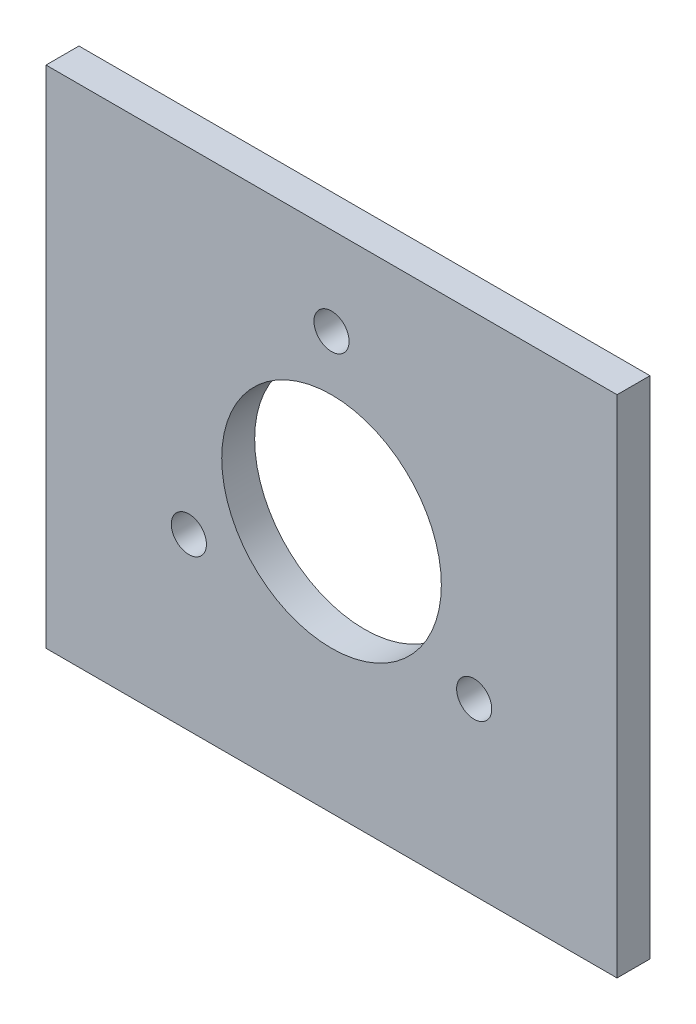
ISO-10303-21;
HEADER;
FILE_DESCRIPTION(('STEP AP214'),'2;1');
FILE_NAME('part.step','',(''),(''),'','','');
FILE_SCHEMA(('AUTOMOTIVE_DESIGN { 1 0 10303 214 1 1 1 1 }'));
ENDSEC;
DATA;
#1=APPLICATION_CONTEXT('core data for automotive mechanical design processes');
#2=APPLICATION_PROTOCOL_DEFINITION('international standard','automotive_design',2000,#1);
#3=PRODUCT_CONTEXT('',#1,'mechanical');
#4=PRODUCT('Part','Part','',(#3));
#5=PRODUCT_RELATED_PRODUCT_CATEGORY('part','',(#4));
#6=PRODUCT_DEFINITION_FORMATION('','',#4);
#7=PRODUCT_DEFINITION_CONTEXT('part definition',#1,'design');
#8=PRODUCT_DEFINITION('design','',#6,#7);
#9=PRODUCT_DEFINITION_SHAPE('','',#8);
#10=(LENGTH_UNIT() NAMED_UNIT(*) SI_UNIT(.MILLI.,.METRE.));
#11=(NAMED_UNIT(*) PLANE_ANGLE_UNIT() SI_UNIT($,.RADIAN.));
#12=(NAMED_UNIT(*) SI_UNIT($,.STERADIAN.) SOLID_ANGLE_UNIT());
#13=UNCERTAINTY_MEASURE_WITH_UNIT(LENGTH_MEASURE(1.E-05),#10,'distance_accuracy_value','');
#14=(GEOMETRIC_REPRESENTATION_CONTEXT(3) GLOBAL_UNCERTAINTY_ASSIGNED_CONTEXT((#13)) GLOBAL_UNIT_ASSIGNED_CONTEXT((#10,
#11,#12)) REPRESENTATION_CONTEXT('',''));
#15=CARTESIAN_POINT('',(0.,0.,0.));
#16=DIRECTION('',(0.,0.,1.));
#17=DIRECTION('',(1.,0.,0.));
#18=AXIS2_PLACEMENT_3D('',#15,#16,#17);
#19=CARTESIAN_POINT('',(-26.,-23.,3.));
#20=DIRECTION('',(1.,0.,0.));
#21=DIRECTION('',(0.,0.,-1.));
#22=AXIS2_PLACEMENT_3D('',#19,#20,#21);
#23=PLANE('',#22);
#24=DIRECTION('',(0.,-1.,0.));
#25=VECTOR('',#24,1.);
#26=CARTESIAN_POINT('',(-26.,-23.,0.));
#27=LINE('',#26,#25);
#28=CARTESIAN_POINT('',(-26.,23.,0.));
#29=VERTEX_POINT('',#28);
#30=CARTESIAN_POINT('',(-26.,-23.,0.));
#31=VERTEX_POINT('',#30);
#32=EDGE_CURVE('E102',#29,#31,#27,.T.);
#33=ORIENTED_EDGE('',*,*,#32,.T.);
#34=DIRECTION('',(0.,0.,-1.));
#35=VECTOR('',#34,1.);
#36=CARTESIAN_POINT('',(-26.,-23.,3.));
#37=LINE('',#36,#35);
#38=CARTESIAN_POINT('',(-26.,-23.,3.));
#39=VERTEX_POINT('',#38);
#40=EDGE_CURVE('E11',#39,#31,#37,.T.);
#41=ORIENTED_EDGE('',*,*,#40,.F.);
#42=DIRECTION('',(0.,-1.,0.));
#43=VECTOR('',#42,1.);
#44=CARTESIAN_POINT('',(-26.,-23.,3.));
#45=LINE('',#44,#43);
#46=CARTESIAN_POINT('',(-26.,23.,3.));
#47=VERTEX_POINT('',#46);
#48=EDGE_CURVE('E90',#47,#39,#45,.T.);
#49=ORIENTED_EDGE('',*,*,#48,.F.);
#50=DIRECTION('',(0.,0.,-1.));
#51=VECTOR('',#50,1.);
#52=CARTESIAN_POINT('',(-26.,23.,3.));
#53=LINE('',#52,#51);
#54=EDGE_CURVE('E98',#47,#29,#53,.T.);
#55=ORIENTED_EDGE('',*,*,#54,.T.);
#56=EDGE_LOOP('',(#33,#41,#49,#55));
#57=FACE_BOUND('',#56,.T.);
#58=ADVANCED_FACE('F39',(#57),#23,.F.);
#59=CARTESIAN_POINT('',(26.,-23.,3.));
#60=DIRECTION('',(0.,1.,0.));
#61=DIRECTION('',(-1.,0.,0.));
#62=AXIS2_PLACEMENT_3D('',#59,#60,#61);
#63=PLANE('',#62);
#64=DIRECTION('',(1.,0.,0.));
#65=VECTOR('',#64,1.);
#66=CARTESIAN_POINT('',(26.,-23.,0.));
#67=LINE('',#66,#65);
#68=CARTESIAN_POINT('',(26.,-23.,0.));
#69=VERTEX_POINT('',#68);
#70=EDGE_CURVE('E94',#31,#69,#67,.T.);
#71=ORIENTED_EDGE('',*,*,#70,.T.);
#72=DIRECTION('',(0.,0.,-1.));
#73=VECTOR('',#72,1.);
#74=CARTESIAN_POINT('',(26.,-23.,3.));
#75=LINE('',#74,#73);
#76=CARTESIAN_POINT('',(26.,-23.,3.));
#77=VERTEX_POINT('',#76);
#78=EDGE_CURVE('E47',#77,#69,#75,.T.);
#79=ORIENTED_EDGE('',*,*,#78,.F.);
#80=DIRECTION('',(1.,0.,0.));
#81=VECTOR('',#80,1.);
#82=CARTESIAN_POINT('',(26.,-23.,3.));
#83=LINE('',#82,#81);
#84=EDGE_CURVE('E85',#39,#77,#83,.T.);
#85=ORIENTED_EDGE('',*,*,#84,.F.);
#86=ORIENTED_EDGE('',*,*,#40,.T.);
#87=EDGE_LOOP('',(#71,#79,#85,#86));
#88=FACE_BOUND('',#87,.T.);
#89=ADVANCED_FACE('F93',(#88),#63,.F.);
#90=CARTESIAN_POINT('',(26.,-23.,3.));
#91=DIRECTION('',(-1.,0.,0.));
#92=DIRECTION('',(0.,0.,1.));
#93=AXIS2_PLACEMENT_3D('',#90,#91,#92);
#94=PLANE('',#93);
#95=DIRECTION('',(0.,1.,0.));
#96=VECTOR('',#95,1.);
#97=CARTESIAN_POINT('',(26.,-23.,0.));
#98=LINE('',#97,#96);
#99=CARTESIAN_POINT('',(26.,23.,0.));
#100=VERTEX_POINT('',#99);
#101=EDGE_CURVE('E72',#69,#100,#98,.T.);
#102=ORIENTED_EDGE('',*,*,#101,.T.);
#103=DIRECTION('',(0.,0.,-1.));
#104=VECTOR('',#103,1.);
#105=CARTESIAN_POINT('',(26.,23.,3.));
#106=LINE('',#105,#104);
#107=CARTESIAN_POINT('',(26.,23.,3.));
#108=VERTEX_POINT('',#107);
#109=EDGE_CURVE('E95',#108,#100,#106,.T.);
#110=ORIENTED_EDGE('',*,*,#109,.F.);
#111=DIRECTION('',(0.,1.,0.));
#112=VECTOR('',#111,1.);
#113=CARTESIAN_POINT('',(26.,-23.,3.));
#114=LINE('',#113,#112);
#115=EDGE_CURVE('E88',#77,#108,#114,.T.);
#116=ORIENTED_EDGE('',*,*,#115,.F.);
#117=ORIENTED_EDGE('',*,*,#78,.T.);
#118=EDGE_LOOP('',(#102,#110,#116,#117));
#119=FACE_BOUND('',#118,.T.);
#120=ADVANCED_FACE('F96',(#119),#94,.F.);
#121=CARTESIAN_POINT('',(26.,23.,3.));
#122=DIRECTION('',(0.,-1.,0.));
#123=DIRECTION('',(1.,0.,0.));
#124=AXIS2_PLACEMENT_3D('',#121,#122,#123);
#125=PLANE('',#124);
#126=DIRECTION('',(-1.,0.,0.));
#127=VECTOR('',#126,1.);
#128=CARTESIAN_POINT('',(26.,23.,0.));
#129=LINE('',#128,#127);
#130=EDGE_CURVE('E78',#100,#29,#129,.T.);
#131=ORIENTED_EDGE('',*,*,#130,.T.);
#132=ORIENTED_EDGE('',*,*,#54,.F.);
#133=DIRECTION('',(-1.,0.,0.));
#134=VECTOR('',#133,1.);
#135=CARTESIAN_POINT('',(26.,23.,3.));
#136=LINE('',#135,#134);
#137=EDGE_CURVE('E55',#108,#47,#136,.T.);
#138=ORIENTED_EDGE('',*,*,#137,.F.);
#139=ORIENTED_EDGE('',*,*,#109,.T.);
#140=EDGE_LOOP('',(#131,#132,#138,#139));
#141=FACE_BOUND('',#140,.T.);
#142=ADVANCED_FACE('F110',(#141),#125,.F.);
#143=CARTESIAN_POINT('',(0.,0.,3.));
#144=DIRECTION('',(0.,0.,1.));
#145=DIRECTION('',(1.,0.,0.));
#146=AXIS2_PLACEMENT_3D('',#143,#144,#145);
#147=PLANE('',#146);
#148=CARTESIAN_POINT('',(-12.9903810567656,-7.50000000000056,3.));
#149=DIRECTION('',(0.,0.,1.));
#150=DIRECTION('',(1.,0.,0.));
#151=AXIS2_PLACEMENT_3D('',#148,#149,#150);
#152=CIRCLE('',#151,1.60000000000122);
#153=CARTESIAN_POINT('',(-11.3903810567644,-7.50000000000056,3.));
#154=VERTEX_POINT('',#153);
#155=EDGE_CURVE('E125',#154,#154,#152,.T.);
#156=ORIENTED_EDGE('',*,*,#155,.F.);
#157=EDGE_LOOP('',(#156));
#158=FACE_BOUND('',#157,.T.);
#159=CARTESIAN_POINT('',(12.9903810567675,-7.49999999999945,3.));
#160=DIRECTION('',(0.,0.,1.));
#161=DIRECTION('',(1.,0.,0.));
#162=AXIS2_PLACEMENT_3D('',#159,#160,#161);
#163=CIRCLE('',#162,1.60000000000082);
#164=CARTESIAN_POINT('',(14.5903810567684,-7.49999999999945,3.));
#165=VERTEX_POINT('',#164);
#166=EDGE_CURVE('E131',#165,#165,#163,.T.);
#167=ORIENTED_EDGE('',*,*,#166,.F.);
#168=EDGE_LOOP('',(#167));
#169=FACE_BOUND('',#168,.T.);
#170=CARTESIAN_POINT('',(0.,15.,3.));
#171=DIRECTION('',(0.,0.,1.));
#172=DIRECTION('',(1.,0.,0.));
#173=AXIS2_PLACEMENT_3D('',#170,#171,#172);
#174=CIRCLE('',#173,1.6);
#175=CARTESIAN_POINT('',(1.6,15.,3.));
#176=VERTEX_POINT('',#175);
#177=EDGE_CURVE('E119',#176,#176,#174,.T.);
#178=ORIENTED_EDGE('',*,*,#177,.F.);
#179=EDGE_LOOP('',(#178));
#180=FACE_BOUND('',#179,.T.);
#181=CARTESIAN_POINT('',(0.,0.,3.));
#182=DIRECTION('',(0.,0.,1.));
#183=DIRECTION('',(1.,0.,0.));
#184=AXIS2_PLACEMENT_3D('',#181,#182,#183);
#185=CIRCLE('',#184,10.);
#186=CARTESIAN_POINT('',(10.,0.,3.));
#187=VERTEX_POINT('',#186);
#188=EDGE_CURVE('E116',#187,#187,#185,.T.);
#189=ORIENTED_EDGE('',*,*,#188,.F.);
#190=EDGE_LOOP('',(#189));
#191=FACE_BOUND('',#190,.T.);
#192=ORIENTED_EDGE('',*,*,#48,.T.);
#193=ORIENTED_EDGE('',*,*,#84,.T.);
#194=ORIENTED_EDGE('',*,*,#115,.T.);
#195=ORIENTED_EDGE('',*,*,#137,.T.);
#196=EDGE_LOOP('',(#192,#193,#194,#195));
#197=FACE_BOUND('',#196,.T.);
#198=ADVANCED_FACE('F86',(#158,#169,#180,#191,#197),#147,.T.);
#199=CARTESIAN_POINT('',(0.,0.,0.));
#200=DIRECTION('',(0.,0.,1.));
#201=DIRECTION('',(1.,0.,0.));
#202=AXIS2_PLACEMENT_3D('',#199,#200,#201);
#203=PLANE('',#202);
#204=CARTESIAN_POINT('',(-12.9903810567656,-7.50000000000056,0.));
#205=DIRECTION('',(0.,0.,1.));
#206=DIRECTION('',(1.,0.,0.));
#207=AXIS2_PLACEMENT_3D('',#204,#205,#206);
#208=CIRCLE('',#207,1.60000000000122);
#209=CARTESIAN_POINT('',(-11.3903810567644,-7.50000000000056,0.));
#210=VERTEX_POINT('',#209);
#211=EDGE_CURVE('E122',#210,#210,#208,.T.);
#212=ORIENTED_EDGE('',*,*,#211,.T.);
#213=EDGE_LOOP('',(#212));
#214=FACE_BOUND('',#213,.T.);
#215=CARTESIAN_POINT('',(12.9903810567675,-7.49999999999945,0.));
#216=DIRECTION('',(0.,0.,1.));
#217=DIRECTION('',(1.,0.,0.));
#218=AXIS2_PLACEMENT_3D('',#215,#216,#217);
#219=CIRCLE('',#218,1.60000000000082);
#220=CARTESIAN_POINT('',(14.5903810567684,-7.49999999999945,0.));
#221=VERTEX_POINT('',#220);
#222=EDGE_CURVE('E128',#221,#221,#219,.T.);
#223=ORIENTED_EDGE('',*,*,#222,.T.);
#224=EDGE_LOOP('',(#223));
#225=FACE_BOUND('',#224,.T.);
#226=CARTESIAN_POINT('',(0.,15.,0.));
#227=DIRECTION('',(0.,0.,1.));
#228=DIRECTION('',(1.,0.,0.));
#229=AXIS2_PLACEMENT_3D('',#226,#227,#228);
#230=CIRCLE('',#229,1.6);
#231=CARTESIAN_POINT('',(1.6,15.,0.));
#232=VERTEX_POINT('',#231);
#233=EDGE_CURVE('E134',#232,#232,#230,.T.);
#234=ORIENTED_EDGE('',*,*,#233,.T.);
#235=EDGE_LOOP('',(#234));
#236=FACE_BOUND('',#235,.T.);
#237=CARTESIAN_POINT('',(0.,0.,0.));
#238=DIRECTION('',(0.,0.,1.));
#239=DIRECTION('',(1.,0.,0.));
#240=AXIS2_PLACEMENT_3D('',#237,#238,#239);
#241=CIRCLE('',#240,10.);
#242=CARTESIAN_POINT('',(10.,0.,0.));
#243=VERTEX_POINT('',#242);
#244=EDGE_CURVE('E105',#243,#243,#241,.T.);
#245=ORIENTED_EDGE('',*,*,#244,.T.);
#246=EDGE_LOOP('',(#245));
#247=FACE_BOUND('',#246,.T.);
#248=ORIENTED_EDGE('',*,*,#32,.F.);
#249=ORIENTED_EDGE('',*,*,#130,.F.);
#250=ORIENTED_EDGE('',*,*,#101,.F.);
#251=ORIENTED_EDGE('',*,*,#70,.F.);
#252=EDGE_LOOP('',(#248,#249,#250,#251));
#253=FACE_BOUND('',#252,.T.);
#254=ADVANCED_FACE('F113',(#214,#225,#236,#247,#253),#203,.F.);
#255=CARTESIAN_POINT('',(0.,0.,0.));
#256=DIRECTION('',(0.,0.,1.));
#257=DIRECTION('',(1.,0.,0.));
#258=AXIS2_PLACEMENT_3D('',#255,#256,#257);
#259=CYLINDRICAL_SURFACE('',#258,10.);
#260=ORIENTED_EDGE('',*,*,#244,.F.);
#261=EDGE_LOOP('',(#260));
#262=FACE_BOUND('',#261,.T.);
#263=ORIENTED_EDGE('',*,*,#188,.T.);
#264=EDGE_LOOP('',(#263));
#265=FACE_BOUND('',#264,.T.);
#266=ADVANCED_FACE('F148',(#262,#265),#259,.F.);
#267=CARTESIAN_POINT('',(0.,15.,0.));
#268=DIRECTION('',(0.,0.,1.));
#269=DIRECTION('',(1.,0.,0.));
#270=AXIS2_PLACEMENT_3D('',#267,#268,#269);
#271=CYLINDRICAL_SURFACE('',#270,1.6);
#272=ORIENTED_EDGE('',*,*,#233,.F.);
#273=EDGE_LOOP('',(#272));
#274=FACE_BOUND('',#273,.T.);
#275=ORIENTED_EDGE('',*,*,#177,.T.);
#276=EDGE_LOOP('',(#275));
#277=FACE_BOUND('',#276,.T.);
#278=ADVANCED_FACE('F140',(#274,#277),#271,.F.);
#279=CARTESIAN_POINT('',(12.9903810567675,-7.49999999999945,0.));
#280=DIRECTION('',(0.,0.,1.));
#281=DIRECTION('',(1.,0.,0.));
#282=AXIS2_PLACEMENT_3D('',#279,#280,#281);
#283=CYLINDRICAL_SURFACE('',#282,1.60000000000082);
#284=ORIENTED_EDGE('',*,*,#222,.F.);
#285=EDGE_LOOP('',(#284));
#286=FACE_BOUND('',#285,.T.);
#287=ORIENTED_EDGE('',*,*,#166,.T.);
#288=EDGE_LOOP('',(#287));
#289=FACE_BOUND('',#288,.T.);
#290=ADVANCED_FACE('F156',(#286,#289),#283,.F.);
#291=CARTESIAN_POINT('',(-12.9903810567656,-7.50000000000056,0.));
#292=DIRECTION('',(0.,0.,1.));
#293=DIRECTION('',(1.,0.,0.));
#294=AXIS2_PLACEMENT_3D('',#291,#292,#293);
#295=CYLINDRICAL_SURFACE('',#294,1.60000000000122);
#296=ORIENTED_EDGE('',*,*,#211,.F.);
#297=EDGE_LOOP('',(#296));
#298=FACE_BOUND('',#297,.T.);
#299=ORIENTED_EDGE('',*,*,#155,.T.);
#300=EDGE_LOOP('',(#299));
#301=FACE_BOUND('',#300,.T.);
#302=ADVANCED_FACE('F207',(#298,#301),#295,.F.);
#303=CLOSED_SHELL('',(#58,#89,#120,#142,#198,#254,#266,#278,#290,#302));
#304=MANIFOLD_SOLID_BREP('B2',#303);
#305=ADVANCED_BREP_SHAPE_REPRESENTATION('',(#18,#304),#14);
#306=SHAPE_DEFINITION_REPRESENTATION(#9,#305);
ENDSEC;
END-ISO-10303-21;
